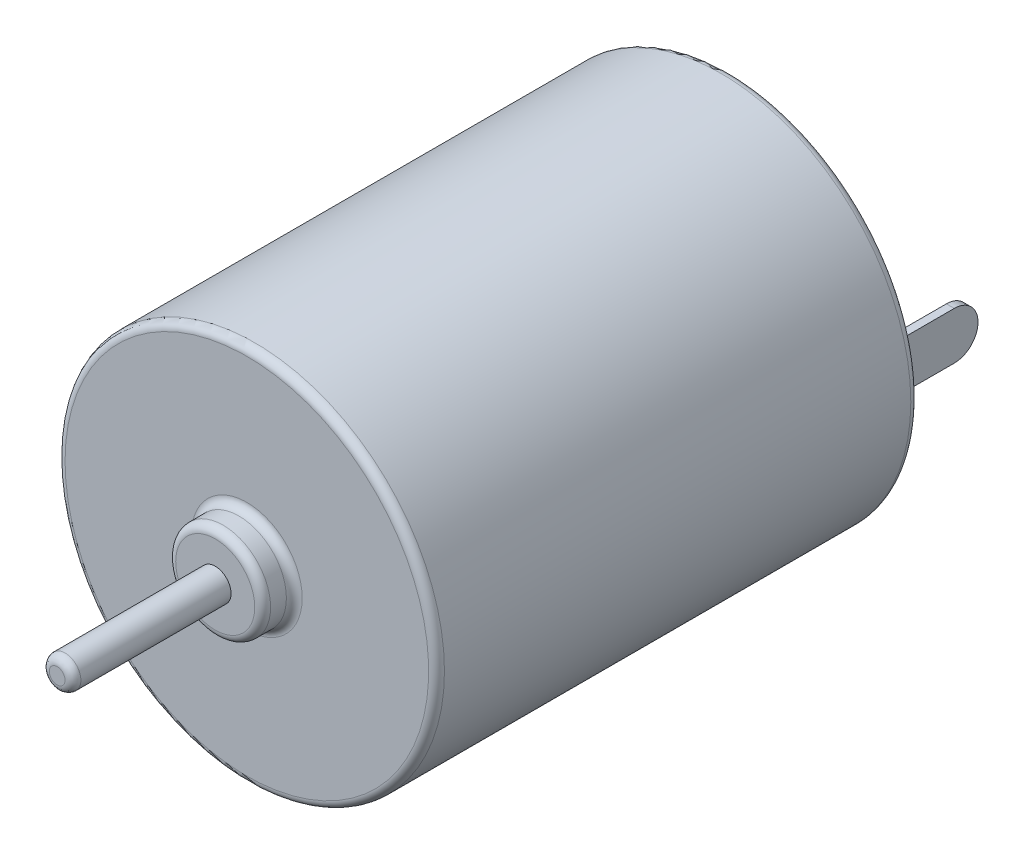
ISO-10303-21;
HEADER;
FILE_DESCRIPTION(('STEP AP214'),'2;1');
FILE_NAME('part.step','',(''),(''),'','','');
FILE_SCHEMA(('AUTOMOTIVE_DESIGN { 1 0 10303 214 1 1 1 1 }'));
ENDSEC;
DATA;
#1=APPLICATION_CONTEXT('core data for automotive mechanical design processes');
#2=APPLICATION_PROTOCOL_DEFINITION('international standard','automotive_design',2000,#1);
#3=PRODUCT_CONTEXT('',#1,'mechanical');
#4=PRODUCT('Part','Part','',(#3));
#5=PRODUCT_RELATED_PRODUCT_CATEGORY('part','',(#4));
#6=PRODUCT_DEFINITION_FORMATION('','',#4);
#7=PRODUCT_DEFINITION_CONTEXT('part definition',#1,'design');
#8=PRODUCT_DEFINITION('design','',#6,#7);
#9=PRODUCT_DEFINITION_SHAPE('','',#8);
#10=(LENGTH_UNIT() NAMED_UNIT(*) SI_UNIT(.MILLI.,.METRE.));
#11=(NAMED_UNIT(*) PLANE_ANGLE_UNIT() SI_UNIT($,.RADIAN.));
#12=(NAMED_UNIT(*) SI_UNIT($,.STERADIAN.) SOLID_ANGLE_UNIT());
#13=UNCERTAINTY_MEASURE_WITH_UNIT(LENGTH_MEASURE(1.E-05),#10,'distance_accuracy_value','');
#14=(GEOMETRIC_REPRESENTATION_CONTEXT(3) GLOBAL_UNCERTAINTY_ASSIGNED_CONTEXT((#13)) GLOBAL_UNIT_ASSIGNED_CONTEXT((#10,
#11,#12)) REPRESENTATION_CONTEXT('',''));
#15=CARTESIAN_POINT('',(0.,0.,0.));
#16=DIRECTION('',(0.,0.,1.));
#17=DIRECTION('',(1.,0.,0.));
#18=AXIS2_PLACEMENT_3D('',#15,#16,#17);
#19=CARTESIAN_POINT('',(9.75,-1.5,0.));
#20=DIRECTION('',(0.,-1.,0.));
#21=DIRECTION('',(0.,0.,-1.));
#22=AXIS2_PLACEMENT_3D('',#19,#20,#21);
#23=PLANE('',#22);
#24=DIRECTION('',(1.,0.,0.));
#25=VECTOR('',#24,1.);
#26=CARTESIAN_POINT('',(4.875,-1.5,-0.5));
#27=LINE('',#26,#25);
#28=CARTESIAN_POINT('',(9.25,-1.5,-0.5));
#29=VERTEX_POINT('',#28);
#30=CARTESIAN_POINT('',(9.75,-1.5,-0.5));
#31=VERTEX_POINT('',#30);
#32=EDGE_CURVE('E336',#29,#31,#27,.T.);
#33=ORIENTED_EDGE('',*,*,#32,.F.);
#34=DIRECTION('',(0.,0.,-1.));
#35=VECTOR('',#34,1.);
#36=CARTESIAN_POINT('',(9.25,-1.5,0.));
#37=LINE('',#36,#35);
#38=CARTESIAN_POINT('',(9.25,-1.5,-4.5));
#39=VERTEX_POINT('',#38);
#40=EDGE_CURVE('E11',#29,#39,#37,.T.);
#41=ORIENTED_EDGE('',*,*,#40,.T.);
#42=DIRECTION('',(-1.,0.,0.));
#43=VECTOR('',#42,1.);
#44=CARTESIAN_POINT('',(9.625,-1.5,-4.5));
#45=LINE('',#44,#43);
#46=CARTESIAN_POINT('',(9.75,-1.5,-4.5));
#47=VERTEX_POINT('',#46);
#48=EDGE_CURVE('E323',#47,#39,#45,.T.);
#49=ORIENTED_EDGE('',*,*,#48,.F.);
#50=DIRECTION('',(0.,0.,-1.));
#51=VECTOR('',#50,1.);
#52=CARTESIAN_POINT('',(9.75,-1.5,0.));
#53=LINE('',#52,#51);
#54=EDGE_CURVE('E237',#31,#47,#53,.T.);
#55=ORIENTED_EDGE('',*,*,#54,.F.);
#56=EDGE_LOOP('',(#33,#41,#49,#55));
#57=FACE_BOUND('',#56,.T.);
#58=ADVANCED_FACE('F16',(#57),#23,.T.);
#59=CARTESIAN_POINT('',(9.25,-1.5,0.));
#60=DIRECTION('',(-1.,0.,0.));
#61=DIRECTION('',(0.,0.,1.));
#62=AXIS2_PLACEMENT_3D('',#59,#60,#61);
#63=PLANE('',#62);
#64=DIRECTION('',(0.,-1.,0.));
#65=VECTOR('',#64,1.);
#66=CARTESIAN_POINT('',(9.25,-0.75,-0.5));
#67=LINE('',#66,#65);
#68=CARTESIAN_POINT('',(9.25,1.5,-0.5));
#69=VERTEX_POINT('',#68);
#70=EDGE_CURVE('E311',#69,#29,#67,.T.);
#71=ORIENTED_EDGE('',*,*,#70,.F.);
#72=DIRECTION('',(0.,0.,-1.));
#73=VECTOR('',#72,1.);
#74=CARTESIAN_POINT('',(9.25,1.5,0.));
#75=LINE('',#74,#73);
#76=CARTESIAN_POINT('',(9.25,1.5,-4.5));
#77=VERTEX_POINT('',#76);
#78=EDGE_CURVE('E250',#69,#77,#75,.T.);
#79=ORIENTED_EDGE('',*,*,#78,.T.);
#80=CARTESIAN_POINT('',(9.25,0.,-4.5));
#81=DIRECTION('',(1.,0.,0.));
#82=DIRECTION('',(0.,0.707106781186547,-0.707106781186548));
#83=AXIS2_PLACEMENT_3D('',#80,#81,#82);
#84=CIRCLE('',#83,1.5);
#85=EDGE_CURVE('E27',#39,#77,#84,.T.);
#86=ORIENTED_EDGE('',*,*,#85,.F.);
#87=ORIENTED_EDGE('',*,*,#40,.F.);
#88=EDGE_LOOP('',(#71,#79,#86,#87));
#89=FACE_BOUND('',#88,.T.);
#90=ADVANCED_FACE('F537',(#89),#63,.T.);
#91=CARTESIAN_POINT('',(-9.25,-1.5,0.));
#92=DIRECTION('',(0.,-1.,0.));
#93=DIRECTION('',(0.,0.,-1.));
#94=AXIS2_PLACEMENT_3D('',#91,#92,#93);
#95=PLANE('',#94);
#96=DIRECTION('',(1.,0.,0.));
#97=VECTOR('',#96,1.);
#98=CARTESIAN_POINT('',(-4.625,-1.5,-0.5));
#99=LINE('',#98,#97);
#100=CARTESIAN_POINT('',(-9.75,-1.5,-0.5));
#101=VERTEX_POINT('',#100);
#102=CARTESIAN_POINT('',(-9.25,-1.5,-0.5));
#103=VERTEX_POINT('',#102);
#104=EDGE_CURVE('E272',#101,#103,#99,.T.);
#105=ORIENTED_EDGE('',*,*,#104,.F.);
#106=DIRECTION('',(0.,0.,-1.));
#107=VECTOR('',#106,1.);
#108=CARTESIAN_POINT('',(-9.75,-1.5,0.));
#109=LINE('',#108,#107);
#110=CARTESIAN_POINT('',(-9.75,-1.5,-4.5));
#111=VERTEX_POINT('',#110);
#112=EDGE_CURVE('E362',#101,#111,#109,.T.);
#113=ORIENTED_EDGE('',*,*,#112,.T.);
#114=DIRECTION('',(-1.,0.,0.));
#115=VECTOR('',#114,1.);
#116=CARTESIAN_POINT('',(-9.375,-1.5,-4.5));
#117=LINE('',#116,#115);
#118=CARTESIAN_POINT('',(-9.25,-1.5,-4.5));
#119=VERTEX_POINT('',#118);
#120=EDGE_CURVE('E426',#119,#111,#117,.T.);
#121=ORIENTED_EDGE('',*,*,#120,.F.);
#122=DIRECTION('',(0.,0.,-1.));
#123=VECTOR('',#122,1.);
#124=CARTESIAN_POINT('',(-9.25,-1.5,0.));
#125=LINE('',#124,#123);
#126=EDGE_CURVE('E267',#103,#119,#125,.T.);
#127=ORIENTED_EDGE('',*,*,#126,.F.);
#128=EDGE_LOOP('',(#105,#113,#121,#127));
#129=FACE_BOUND('',#128,.T.);
#130=ADVANCED_FACE('F478',(#129),#95,.T.);
#131=CARTESIAN_POINT('',(9.375,0.,-4.5));
#132=DIRECTION('',(1.,0.,0.));
#133=DIRECTION('',(0.,0.707106781186547,-0.707106781186548));
#134=AXIS2_PLACEMENT_3D('',#131,#132,#133);
#135=CYLINDRICAL_SURFACE('',#134,1.5);
#136=CARTESIAN_POINT('',(9.75,0.,-4.5));
#137=DIRECTION('',(-1.,0.,0.));
#138=DIRECTION('',(0.,-0.707106781186547,-0.707106781186548));
#139=AXIS2_PLACEMENT_3D('',#136,#137,#138);
#140=CIRCLE('',#139,1.5);
#141=CARTESIAN_POINT('',(9.75,1.5,-4.5));
#142=VERTEX_POINT('',#141);
#143=EDGE_CURVE('E344',#142,#47,#140,.T.);
#144=ORIENTED_EDGE('',*,*,#143,.T.);
#145=ORIENTED_EDGE('',*,*,#48,.T.);
#146=ORIENTED_EDGE('',*,*,#85,.T.);
#147=DIRECTION('',(1.,0.,0.));
#148=VECTOR('',#147,1.);
#149=CARTESIAN_POINT('',(9.375,1.5,-4.5));
#150=LINE('',#149,#148);
#151=EDGE_CURVE('E254',#77,#142,#150,.T.);
#152=ORIENTED_EDGE('',*,*,#151,.T.);
#153=EDGE_LOOP('',(#144,#145,#146,#152));
#154=FACE_BOUND('',#153,.T.);
#155=ADVANCED_FACE('F794',(#154),#135,.T.);
#156=CARTESIAN_POINT('',(-9.625,0.,-4.5));
#157=DIRECTION('',(1.,0.,0.));
#158=DIRECTION('',(0.,0.707106781186547,-0.707106781186548));
#159=AXIS2_PLACEMENT_3D('',#156,#157,#158);
#160=CYLINDRICAL_SURFACE('',#159,1.5);
#161=CARTESIAN_POINT('',(-9.25,0.,-4.5));
#162=DIRECTION('',(-1.,0.,0.));
#163=DIRECTION('',(0.,-0.707106781186547,-0.707106781186548));
#164=AXIS2_PLACEMENT_3D('',#161,#162,#163);
#165=CIRCLE('',#164,1.5);
#166=CARTESIAN_POINT('',(-9.25,1.5,-4.5));
#167=VERTEX_POINT('',#166);
#168=EDGE_CURVE('E384',#167,#119,#165,.T.);
#169=ORIENTED_EDGE('',*,*,#168,.T.);
#170=ORIENTED_EDGE('',*,*,#120,.T.);
#171=CARTESIAN_POINT('',(-9.75,0.,-4.5));
#172=DIRECTION('',(1.,0.,0.));
#173=DIRECTION('',(0.,0.707106781186547,-0.707106781186548));
#174=AXIS2_PLACEMENT_3D('',#171,#172,#173);
#175=CIRCLE('',#174,1.5);
#176=CARTESIAN_POINT('',(-9.75,1.5,-4.5));
#177=VERTEX_POINT('',#176);
#178=EDGE_CURVE('E261',#111,#177,#175,.T.);
#179=ORIENTED_EDGE('',*,*,#178,.T.);
#180=DIRECTION('',(1.,0.,0.));
#181=VECTOR('',#180,1.);
#182=CARTESIAN_POINT('',(-9.625,1.5,-4.5));
#183=LINE('',#182,#181);
#184=EDGE_CURVE('E368',#177,#167,#183,.T.);
#185=ORIENTED_EDGE('',*,*,#184,.T.);
#186=EDGE_LOOP('',(#169,#170,#179,#185));
#187=FACE_BOUND('',#186,.T.);
#188=ADVANCED_FACE('F452',(#187),#160,.T.);
#189=CARTESIAN_POINT('',(-9.25,1.5,0.));
#190=DIRECTION('',(1.,0.,0.));
#191=DIRECTION('',(0.,1.,0.));
#192=AXIS2_PLACEMENT_3D('',#189,#190,#191);
#193=PLANE('',#192);
#194=DIRECTION('',(0.,1.,0.));
#195=VECTOR('',#194,1.);
#196=CARTESIAN_POINT('',(-9.25,0.75,-0.5));
#197=LINE('',#196,#195);
#198=CARTESIAN_POINT('',(-9.25,1.5,-0.5));
#199=VERTEX_POINT('',#198);
#200=EDGE_CURVE('E262',#103,#199,#197,.T.);
#201=ORIENTED_EDGE('',*,*,#200,.F.);
#202=ORIENTED_EDGE('',*,*,#126,.T.);
#203=ORIENTED_EDGE('',*,*,#168,.F.);
#204=DIRECTION('',(0.,0.,-1.));
#205=VECTOR('',#204,1.);
#206=CARTESIAN_POINT('',(-9.25,1.5,0.));
#207=LINE('',#206,#205);
#208=EDGE_CURVE('E381',#199,#167,#207,.T.);
#209=ORIENTED_EDGE('',*,*,#208,.F.);
#210=EDGE_LOOP('',(#201,#202,#203,#209));
#211=FACE_BOUND('',#210,.T.);
#212=ADVANCED_FACE('F459',(#211),#193,.T.);
#213=CARTESIAN_POINT('',(0.,0.,-2.5));
#214=DIRECTION('',(0.,0.,-1.));
#215=DIRECTION('',(0.,-1.,0.));
#216=AXIS2_PLACEMENT_3D('',#213,#214,#215);
#217=PLANE('',#216);
#218=CARTESIAN_POINT('',(0.,0.,-2.5));
#219=DIRECTION('',(0.,0.,1.));
#220=DIRECTION('',(1.,0.,0.));
#221=AXIS2_PLACEMENT_3D('',#218,#219,#220);
#222=CIRCLE('',#221,3.5);
#223=CARTESIAN_POINT('',(3.5,0.,-2.5));
#224=VERTEX_POINT('',#223);
#225=EDGE_CURVE('E248',#224,#224,#222,.T.);
#226=ORIENTED_EDGE('',*,*,#225,.F.);
#227=EDGE_LOOP('',(#226));
#228=FACE_BOUND('',#227,.T.);
#229=ADVANCED_FACE('F691',(#228),#217,.T.);
#230=CARTESIAN_POINT('',(0.,0.,-2.));
#231=DIRECTION('',(0.,0.,-1.));
#232=DIRECTION('',(-1.,0.,0.));
#233=AXIS2_PLACEMENT_3D('',#230,#231,#232);
#234=TOROIDAL_SURFACE('',#233,3.5,0.5);
#235=ORIENTED_EDGE('',*,*,#225,.T.);
#236=CARTESIAN_POINT('',(3.5,0.,-2.));
#237=DIRECTION('',(0.,-1.,0.));
#238=DIRECTION('',(1.,0.,0.));
#239=AXIS2_PLACEMENT_3D('',#236,#237,#238);
#240=CIRCLE('',#239,0.5);
#241=CARTESIAN_POINT('',(4.,0.,-2.));
#242=VERTEX_POINT('',#241);
#243=EDGE_CURVE('E264',#224,#242,#240,.T.);
#244=ORIENTED_EDGE('',*,*,#243,.T.);
#245=CARTESIAN_POINT('',(0.,0.,-2.));
#246=DIRECTION('',(0.,0.,-1.));
#247=DIRECTION('',(1.,0.,0.));
#248=AXIS2_PLACEMENT_3D('',#245,#246,#247);
#249=CIRCLE('',#248,4.);
#250=CARTESIAN_POINT('',(-4.,0.,-2.));
#251=VERTEX_POINT('',#250);
#252=EDGE_CURVE('E245',#242,#251,#249,.T.);
#253=ORIENTED_EDGE('',*,*,#252,.T.);
#254=CARTESIAN_POINT('',(0.,0.,-2.));
#255=DIRECTION('',(0.,0.,-1.));
#256=DIRECTION('',(1.,0.,0.));
#257=AXIS2_PLACEMENT_3D('',#254,#255,#256);
#258=CIRCLE('',#257,4.);
#259=EDGE_CURVE('E422',#251,#242,#258,.T.);
#260=ORIENTED_EDGE('',*,*,#259,.T.);
#261=ORIENTED_EDGE('',*,*,#243,.F.);
#262=EDGE_LOOP('',(#235,#244,#253,#260,#261));
#263=FACE_BOUND('',#262,.T.);
#264=ADVANCED_FACE('F697',(#263),#234,.T.);
#265=CARTESIAN_POINT('',(0.,0.,0.));
#266=DIRECTION('',(0.,0.,-1.));
#267=DIRECTION('',(1.,0.,0.));
#268=AXIS2_PLACEMENT_3D('',#265,#266,#267);
#269=CYLINDRICAL_SURFACE('',#268,4.);
#270=ORIENTED_EDGE('',*,*,#259,.F.);
#271=DIRECTION('',(0.,0.,1.));
#272=VECTOR('',#271,1.);
#273=CARTESIAN_POINT('',(-4.,0.,0.));
#274=LINE('',#273,#272);
#275=CARTESIAN_POINT('',(-4.,0.,-0.5));
#276=VERTEX_POINT('',#275);
#277=EDGE_CURVE('E249',#251,#276,#274,.T.);
#278=ORIENTED_EDGE('',*,*,#277,.T.);
#279=CARTESIAN_POINT('',(0.,0.,-0.5));
#280=DIRECTION('',(0.,0.,1.));
#281=DIRECTION('',(1.,0.,0.));
#282=AXIS2_PLACEMENT_3D('',#279,#280,#281);
#283=CIRCLE('',#282,4.);
#284=EDGE_CURVE('E239',#276,#276,#283,.T.);
#285=ORIENTED_EDGE('',*,*,#284,.F.);
#286=ORIENTED_EDGE('',*,*,#277,.F.);
#287=ORIENTED_EDGE('',*,*,#252,.F.);
#288=EDGE_LOOP('',(#270,#278,#285,#286,#287));
#289=FACE_BOUND('',#288,.T.);
#290=ADVANCED_FACE('F565',(#289),#269,.T.);
#291=CARTESIAN_POINT('',(0.,0.,-0.5));
#292=DIRECTION('',(0.,0.,1.));
#293=DIRECTION('',(1.,0.,0.));
#294=AXIS2_PLACEMENT_3D('',#291,#292,#293);
#295=TOROIDAL_SURFACE('',#294,4.5,0.5);
#296=ORIENTED_EDGE('',*,*,#284,.T.);
#297=CARTESIAN_POINT('',(-4.5,0.,-0.5));
#298=DIRECTION('',(0.,-1.,0.));
#299=DIRECTION('',(-1.,0.,0.));
#300=AXIS2_PLACEMENT_3D('',#297,#298,#299);
#301=CIRCLE('',#300,0.5);
#302=CARTESIAN_POINT('',(-4.5,0.,0.));
#303=VERTEX_POINT('',#302);
#304=EDGE_CURVE('E243',#276,#303,#301,.T.);
#305=ORIENTED_EDGE('',*,*,#304,.T.);
#306=CARTESIAN_POINT('',(0.,0.,0.));
#307=DIRECTION('',(0.,0.,-1.));
#308=DIRECTION('',(1.,0.,0.));
#309=AXIS2_PLACEMENT_3D('',#306,#307,#308);
#310=CIRCLE('',#309,4.5);
#311=EDGE_CURVE('E273',#303,#303,#310,.T.);
#312=ORIENTED_EDGE('',*,*,#311,.T.);
#313=ORIENTED_EDGE('',*,*,#304,.F.);
#314=EDGE_LOOP('',(#296,#305,#312,#313));
#315=FACE_BOUND('',#314,.T.);
#316=ADVANCED_FACE('F556',(#315),#295,.F.);
#317=CARTESIAN_POINT('',(0.,0.,0.5));
#318=DIRECTION('',(0.,0.,1.));
#319=DIRECTION('',(1.,0.,0.));
#320=AXIS2_PLACEMENT_3D('',#317,#318,#319);
#321=TOROIDAL_SURFACE('',#320,11.5,0.5);
#322=CARTESIAN_POINT('',(0.,0.,0.5));
#323=DIRECTION('',(0.,0.,-1.));
#324=DIRECTION('',(1.,0.,0.));
#325=AXIS2_PLACEMENT_3D('',#322,#323,#324);
#326=CIRCLE('',#325,12.);
#327=CARTESIAN_POINT('',(-12.,0.,0.5));
#328=VERTEX_POINT('',#327);
#329=EDGE_CURVE('E293',#328,#328,#326,.T.);
#330=ORIENTED_EDGE('',*,*,#329,.T.);
#331=CARTESIAN_POINT('',(-11.5,0.,0.5));
#332=DIRECTION('',(0.,-1.,0.));
#333=DIRECTION('',(-1.,0.,0.));
#334=AXIS2_PLACEMENT_3D('',#331,#332,#333);
#335=CIRCLE('',#334,0.5);
#336=CARTESIAN_POINT('',(-11.5,0.,0.));
#337=VERTEX_POINT('',#336);
#338=EDGE_CURVE('E244',#328,#337,#335,.T.);
#339=ORIENTED_EDGE('',*,*,#338,.T.);
#340=CARTESIAN_POINT('',(0.,0.,0.));
#341=DIRECTION('',(0.,0.,1.));
#342=DIRECTION('',(1.,0.,0.));
#343=AXIS2_PLACEMENT_3D('',#340,#341,#342);
#344=CIRCLE('',#343,11.5);
#345=EDGE_CURVE('E348',#337,#337,#344,.T.);
#346=ORIENTED_EDGE('',*,*,#345,.T.);
#347=ORIENTED_EDGE('',*,*,#338,.F.);
#348=EDGE_LOOP('',(#330,#339,#346,#347));
#349=FACE_BOUND('',#348,.T.);
#350=ADVANCED_FACE('F548',(#349),#321,.T.);
#351=CARTESIAN_POINT('',(0.,0.,32.5));
#352=DIRECTION('',(0.,0.,1.));
#353=DIRECTION('',(1.,0.,0.));
#354=AXIS2_PLACEMENT_3D('',#351,#352,#353);
#355=PLANE('',#354);
#356=CARTESIAN_POINT('',(0.,0.,32.5));
#357=DIRECTION('',(0.,0.,-1.));
#358=DIRECTION('',(-1.,0.,0.));
#359=AXIS2_PLACEMENT_3D('',#356,#357,#358);
#360=CIRCLE('',#359,1.);
#361=CARTESIAN_POINT('',(1.,0.,32.5));
#362=VERTEX_POINT('',#361);
#363=EDGE_CURVE('E257',#362,#362,#360,.T.);
#364=ORIENTED_EDGE('',*,*,#363,.T.);
#365=EDGE_LOOP('',(#364));
#366=FACE_BOUND('',#365,.T.);
#367=CARTESIAN_POINT('',(0.,0.,32.5));
#368=DIRECTION('',(0.,0.,-1.));
#369=DIRECTION('',(-1.,0.,0.));
#370=AXIS2_PLACEMENT_3D('',#367,#368,#369);
#371=CIRCLE('',#370,2.5);
#372=CARTESIAN_POINT('',(-2.5,0.,32.5));
#373=VERTEX_POINT('',#372);
#374=EDGE_CURVE('E282',#373,#373,#371,.T.);
#375=ORIENTED_EDGE('',*,*,#374,.F.);
#376=EDGE_LOOP('',(#375));
#377=FACE_BOUND('',#376,.T.);
#378=ADVANCED_FACE('F555',(#366,#377),#355,.T.);
#379=CARTESIAN_POINT('',(0.,0.,32.));
#380=DIRECTION('',(0.,0.,1.));
#381=DIRECTION('',(1.,0.,0.));
#382=AXIS2_PLACEMENT_3D('',#379,#380,#381);
#383=TOROIDAL_SURFACE('',#382,2.5,0.5);
#384=ORIENTED_EDGE('',*,*,#374,.T.);
#385=CARTESIAN_POINT('',(-2.5,0.,32.));
#386=DIRECTION('',(0.,-1.,0.));
#387=DIRECTION('',(-1.,0.,0.));
#388=AXIS2_PLACEMENT_3D('',#385,#386,#387);
#389=CIRCLE('',#388,0.5);
#390=CARTESIAN_POINT('',(-3.,0.,32.));
#391=VERTEX_POINT('',#390);
#392=EDGE_CURVE('E279',#373,#391,#389,.T.);
#393=ORIENTED_EDGE('',*,*,#392,.T.);
#394=CARTESIAN_POINT('',(0.,0.,32.));
#395=DIRECTION('',(0.,0.,1.));
#396=DIRECTION('',(-1.,0.,0.));
#397=AXIS2_PLACEMENT_3D('',#394,#395,#396);
#398=CIRCLE('',#397,3.);
#399=CARTESIAN_POINT('',(3.,0.,32.));
#400=VERTEX_POINT('',#399);
#401=EDGE_CURVE('E20',#391,#400,#398,.T.);
#402=ORIENTED_EDGE('',*,*,#401,.T.);
#403=CARTESIAN_POINT('',(0.,0.,32.));
#404=DIRECTION('',(0.,0.,1.));
#405=DIRECTION('',(-1.,0.,0.));
#406=AXIS2_PLACEMENT_3D('',#403,#404,#405);
#407=CIRCLE('',#406,3.);
#408=EDGE_CURVE('E396',#400,#391,#407,.T.);
#409=ORIENTED_EDGE('',*,*,#408,.T.);
#410=ORIENTED_EDGE('',*,*,#392,.F.);
#411=EDGE_LOOP('',(#384,#393,#402,#409,#410));
#412=FACE_BOUND('',#411,.T.);
#413=ADVANCED_FACE('F562',(#412),#383,.T.);
#414=CARTESIAN_POINT('',(0.,0.,30.5));
#415=DIRECTION('',(0.,0.,1.));
#416=DIRECTION('',(-1.,0.,0.));
#417=AXIS2_PLACEMENT_3D('',#414,#415,#416);
#418=CYLINDRICAL_SURFACE('',#417,3.);
#419=ORIENTED_EDGE('',*,*,#408,.F.);
#420=DIRECTION('',(0.,0.,-1.));
#421=VECTOR('',#420,1.);
#422=CARTESIAN_POINT('',(3.,0.,30.5));
#423=LINE('',#422,#421);
#424=CARTESIAN_POINT('',(3.,0.,31.));
#425=VERTEX_POINT('',#424);
#426=EDGE_CURVE('E400',#400,#425,#423,.T.);
#427=ORIENTED_EDGE('',*,*,#426,.T.);
#428=CARTESIAN_POINT('',(0.,0.,31.));
#429=DIRECTION('',(0.,0.,-1.));
#430=DIRECTION('',(-1.,0.,0.));
#431=AXIS2_PLACEMENT_3D('',#428,#429,#430);
#432=CIRCLE('',#431,3.);
#433=EDGE_CURVE('E288',#425,#425,#432,.T.);
#434=ORIENTED_EDGE('',*,*,#433,.F.);
#435=ORIENTED_EDGE('',*,*,#426,.F.);
#436=ORIENTED_EDGE('',*,*,#401,.F.);
#437=EDGE_LOOP('',(#419,#427,#434,#435,#436));
#438=FACE_BOUND('',#437,.T.);
#439=ADVANCED_FACE('F722',(#438),#418,.T.);
#440=CARTESIAN_POINT('',(0.,0.,31.));
#441=DIRECTION('',(0.,0.,-1.));
#442=DIRECTION('',(-1.,0.,0.));
#443=AXIS2_PLACEMENT_3D('',#440,#441,#442);
#444=TOROIDAL_SURFACE('',#443,3.5,0.5);
#445=ORIENTED_EDGE('',*,*,#433,.T.);
#446=CARTESIAN_POINT('',(3.5,0.,31.));
#447=DIRECTION('',(0.,-1.,0.));
#448=DIRECTION('',(1.,0.,0.));
#449=AXIS2_PLACEMENT_3D('',#446,#447,#448);
#450=CIRCLE('',#449,0.5);
#451=CARTESIAN_POINT('',(3.5,0.,30.5));
#452=VERTEX_POINT('',#451);
#453=EDGE_CURVE('E292',#425,#452,#450,.T.);
#454=ORIENTED_EDGE('',*,*,#453,.T.);
#455=CARTESIAN_POINT('',(0.,0.,30.5));
#456=DIRECTION('',(0.,0.,1.));
#457=DIRECTION('',(-1.,0.,0.));
#458=AXIS2_PLACEMENT_3D('',#455,#456,#457);
#459=CIRCLE('',#458,3.5);
#460=EDGE_CURVE('E297',#452,#452,#459,.T.);
#461=ORIENTED_EDGE('',*,*,#460,.T.);
#462=ORIENTED_EDGE('',*,*,#453,.F.);
#463=EDGE_LOOP('',(#445,#454,#461,#462));
#464=FACE_BOUND('',#463,.T.);
#465=ADVANCED_FACE('F530',(#464),#444,.F.);
#466=CARTESIAN_POINT('',(0.,0.,0.));
#467=DIRECTION('',(0.,0.,1.));
#468=DIRECTION('',(1.,0.,0.));
#469=AXIS2_PLACEMENT_3D('',#466,#467,#468);
#470=CYLINDRICAL_SURFACE('',#469,12.);
#471=CARTESIAN_POINT('',(0.,0.,30.));
#472=DIRECTION('',(0.,0.,1.));
#473=DIRECTION('',(1.,0.,0.));
#474=AXIS2_PLACEMENT_3D('',#471,#472,#473);
#475=CIRCLE('',#474,12.);
#476=CARTESIAN_POINT('',(-12.,0.,30.));
#477=VERTEX_POINT('',#476);
#478=EDGE_CURVE('E411',#477,#477,#475,.T.);
#479=ORIENTED_EDGE('',*,*,#478,.F.);
#480=DIRECTION('',(0.,0.,-1.));
#481=VECTOR('',#480,1.);
#482=CARTESIAN_POINT('',(-12.,0.,0.));
#483=LINE('',#482,#481);
#484=EDGE_CURVE('E294',#477,#328,#483,.T.);
#485=ORIENTED_EDGE('',*,*,#484,.T.);
#486=ORIENTED_EDGE('',*,*,#329,.F.);
#487=ORIENTED_EDGE('',*,*,#484,.F.);
#488=EDGE_LOOP('',(#479,#485,#486,#487));
#489=FACE_BOUND('',#488,.T.);
#490=ADVANCED_FACE('F521',(#489),#470,.T.);
#491=CARTESIAN_POINT('',(0.,0.,30.5));
#492=DIRECTION('',(0.,0.,1.));
#493=DIRECTION('',(1.,0.,0.));
#494=AXIS2_PLACEMENT_3D('',#491,#492,#493);
#495=PLANE('',#494);
#496=ORIENTED_EDGE('',*,*,#460,.F.);
#497=EDGE_LOOP('',(#496));
#498=FACE_BOUND('',#497,.T.);
#499=CARTESIAN_POINT('',(0.,0.,30.5));
#500=DIRECTION('',(0.,0.,-1.));
#501=DIRECTION('',(1.,0.,0.));
#502=AXIS2_PLACEMENT_3D('',#499,#500,#501);
#503=CIRCLE('',#502,11.5);
#504=CARTESIAN_POINT('',(-11.5,0.,30.5));
#505=VERTEX_POINT('',#504);
#506=EDGE_CURVE('E363',#505,#505,#503,.T.);
#507=ORIENTED_EDGE('',*,*,#506,.F.);
#508=EDGE_LOOP('',(#507));
#509=FACE_BOUND('',#508,.T.);
#510=ADVANCED_FACE('F519',(#498,#509),#495,.T.);
#511=CARTESIAN_POINT('',(0.,0.,30.));
#512=DIRECTION('',(0.,0.,1.));
#513=DIRECTION('',(1.,0.,0.));
#514=AXIS2_PLACEMENT_3D('',#511,#512,#513);
#515=TOROIDAL_SURFACE('',#514,11.5,0.5);
#516=ORIENTED_EDGE('',*,*,#506,.T.);
#517=CARTESIAN_POINT('',(-11.5,0.,30.));
#518=DIRECTION('',(0.,-1.,0.));
#519=DIRECTION('',(-1.,0.,0.));
#520=AXIS2_PLACEMENT_3D('',#517,#518,#519);
#521=CIRCLE('',#520,0.5);
#522=EDGE_CURVE('E367',#505,#477,#521,.T.);
#523=ORIENTED_EDGE('',*,*,#522,.T.);
#524=ORIENTED_EDGE('',*,*,#478,.T.);
#525=ORIENTED_EDGE('',*,*,#522,.F.);
#526=EDGE_LOOP('',(#516,#523,#524,#525));
#527=FACE_BOUND('',#526,.T.);
#528=ADVANCED_FACE('F515',(#527),#515,.T.);
#529=CARTESIAN_POINT('',(-9.75,1.5,0.));
#530=DIRECTION('',(0.,1.,0.));
#531=DIRECTION('',(1.,0.,0.));
#532=AXIS2_PLACEMENT_3D('',#529,#530,#531);
#533=PLANE('',#532);
#534=DIRECTION('',(-1.,0.,0.));
#535=VECTOR('',#534,1.);
#536=CARTESIAN_POINT('',(-4.875,1.5,-0.5));
#537=LINE('',#536,#535);
#538=CARTESIAN_POINT('',(-9.75,1.5,-0.5));
#539=VERTEX_POINT('',#538);
#540=EDGE_CURVE('E271',#199,#539,#537,.T.);
#541=ORIENTED_EDGE('',*,*,#540,.F.);
#542=ORIENTED_EDGE('',*,*,#208,.T.);
#543=ORIENTED_EDGE('',*,*,#184,.F.);
#544=DIRECTION('',(0.,0.,-1.));
#545=VECTOR('',#544,1.);
#546=CARTESIAN_POINT('',(-9.75,1.5,0.));
#547=LINE('',#546,#545);
#548=EDGE_CURVE('E258',#539,#177,#547,.T.);
#549=ORIENTED_EDGE('',*,*,#548,.F.);
#550=EDGE_LOOP('',(#541,#542,#543,#549));
#551=FACE_BOUND('',#550,.T.);
#552=ADVANCED_FACE('F456',(#551),#533,.T.);
#553=CARTESIAN_POINT('',(-9.75,-1.5,0.));
#554=DIRECTION('',(-1.,0.,0.));
#555=DIRECTION('',(0.,0.,1.));
#556=AXIS2_PLACEMENT_3D('',#553,#554,#555);
#557=PLANE('',#556);
#558=DIRECTION('',(0.,-1.,0.));
#559=VECTOR('',#558,1.);
#560=CARTESIAN_POINT('',(-9.75,-0.75,-0.5));
#561=LINE('',#560,#559);
#562=EDGE_CURVE('E369',#539,#101,#561,.T.);
#563=ORIENTED_EDGE('',*,*,#562,.F.);
#564=ORIENTED_EDGE('',*,*,#548,.T.);
#565=ORIENTED_EDGE('',*,*,#178,.F.);
#566=ORIENTED_EDGE('',*,*,#112,.F.);
#567=EDGE_LOOP('',(#563,#564,#565,#566));
#568=FACE_BOUND('',#567,.T.);
#569=ADVANCED_FACE('F481',(#568),#557,.T.);
#570=CARTESIAN_POINT('',(-8.75,0.75,-0.5));
#571=DIRECTION('',(0.,1.,0.));
#572=DIRECTION('',(-0.707106781186548,0.,0.707106781186547));
#573=AXIS2_PLACEMENT_3D('',#570,#571,#572);
#574=CYLINDRICAL_SURFACE('',#573,0.5);
#575=DIRECTION('',(0.,-1.,0.));
#576=VECTOR('',#575,1.);
#577=CARTESIAN_POINT('',(-8.75,0.75,0.));
#578=LINE('',#577,#576);
#579=CARTESIAN_POINT('',(-8.75,2.,0.));
#580=VERTEX_POINT('',#579);
#581=CARTESIAN_POINT('',(-8.75,-2.,0.));
#582=VERTEX_POINT('',#581);
#583=EDGE_CURVE('E278',#580,#582,#578,.T.);
#584=ORIENTED_EDGE('',*,*,#583,.T.);
#585=CARTESIAN_POINT('',(-8.75,-2.,-0.5));
#586=DIRECTION('',(0.707106781186547,0.707106781186548,0.));
#587=DIRECTION('',(-0.707106781186548,0.707106781186547,0.));
#588=AXIS2_PLACEMENT_3D('',#585,#586,#587);
#589=ELLIPSE('',#588,0.707106781186548,0.5);
#590=EDGE_CURVE('E268',#103,#582,#589,.T.);
#591=ORIENTED_EDGE('',*,*,#590,.F.);
#592=ORIENTED_EDGE('',*,*,#200,.T.);
#593=CARTESIAN_POINT('',(-8.75,2.,-0.5));
#594=DIRECTION('',(-0.707106781186547,0.707106781186548,0.));
#595=DIRECTION('',(-0.707106781186548,-0.707106781186547,0.));
#596=AXIS2_PLACEMENT_3D('',#593,#594,#595);
#597=ELLIPSE('',#596,0.707106781186547,0.5);
#598=EDGE_CURVE('E373',#199,#580,#597,.T.);
#599=ORIENTED_EDGE('',*,*,#598,.T.);
#600=EDGE_LOOP('',(#584,#591,#592,#599));
#601=FACE_BOUND('',#600,.T.);
#602=ADVANCED_FACE('F463',(#601),#574,.F.);
#603=CARTESIAN_POINT('',(-10.25,-0.75,-0.5));
#604=DIRECTION('',(0.,-1.,0.));
#605=DIRECTION('',(0.707106781186549,0.,0.707106781186546));
#606=AXIS2_PLACEMENT_3D('',#603,#604,#605);
#607=CYLINDRICAL_SURFACE('',#606,0.5);
#608=DIRECTION('',(0.,1.,0.));
#609=VECTOR('',#608,1.);
#610=CARTESIAN_POINT('',(-10.25,-0.75,0.));
#611=LINE('',#610,#609);
#612=CARTESIAN_POINT('',(-10.25,-2.,0.));
#613=VERTEX_POINT('',#612);
#614=CARTESIAN_POINT('',(-10.25,2.,0.));
#615=VERTEX_POINT('',#614);
#616=EDGE_CURVE('E358',#613,#615,#611,.T.);
#617=ORIENTED_EDGE('',*,*,#616,.T.);
#618=CARTESIAN_POINT('',(-10.25,2.,-0.5));
#619=DIRECTION('',(-0.707106781186547,-0.707106781186548,0.));
#620=DIRECTION('',(0.707106781186548,-0.707106781186547,0.));
#621=AXIS2_PLACEMENT_3D('',#618,#619,#620);
#622=ELLIPSE('',#621,0.707106781186548,0.5);
#623=EDGE_CURVE('E340',#539,#615,#622,.T.);
#624=ORIENTED_EDGE('',*,*,#623,.F.);
#625=ORIENTED_EDGE('',*,*,#562,.T.);
#626=CARTESIAN_POINT('',(-10.25,-2.,-0.5));
#627=DIRECTION('',(-0.707106781186547,0.707106781186548,0.));
#628=DIRECTION('',(-0.707106781186548,-0.707106781186547,0.));
#629=AXIS2_PLACEMENT_3D('',#626,#627,#628);
#630=ELLIPSE('',#629,0.707106781186548,0.5);
#631=EDGE_CURVE('E277',#613,#101,#630,.T.);
#632=ORIENTED_EDGE('',*,*,#631,.F.);
#633=EDGE_LOOP('',(#617,#624,#625,#632));
#634=FACE_BOUND('',#633,.T.);
#635=ADVANCED_FACE('F483',(#634),#607,.F.);
#636=CARTESIAN_POINT('',(-4.875,2.,-0.5));
#637=DIRECTION('',(-1.,0.,0.));
#638=DIRECTION('',(0.,-0.707106781186548,0.707106781186547));
#639=AXIS2_PLACEMENT_3D('',#636,#637,#638);
#640=CYLINDRICAL_SURFACE('',#639,0.5);
#641=ORIENTED_EDGE('',*,*,#540,.T.);
#642=ORIENTED_EDGE('',*,*,#623,.T.);
#643=DIRECTION('',(1.,0.,0.));
#644=VECTOR('',#643,1.);
#645=CARTESIAN_POINT('',(-4.875,2.,0.));
#646=LINE('',#645,#644);
#647=EDGE_CURVE('E354',#615,#580,#646,.T.);
#648=ORIENTED_EDGE('',*,*,#647,.T.);
#649=ORIENTED_EDGE('',*,*,#598,.F.);
#650=EDGE_LOOP('',(#641,#642,#648,#649));
#651=FACE_BOUND('',#650,.T.);
#652=ADVANCED_FACE('F466',(#651),#640,.F.);
#653=CARTESIAN_POINT('',(-4.625,-2.,-0.5));
#654=DIRECTION('',(1.,0.,0.));
#655=DIRECTION('',(0.,0.707106781186548,0.707106781186547));
#656=AXIS2_PLACEMENT_3D('',#653,#654,#655);
#657=CYLINDRICAL_SURFACE('',#656,0.5);
#658=DIRECTION('',(-1.,0.,0.));
#659=VECTOR('',#658,1.);
#660=CARTESIAN_POINT('',(-4.625,-2.,0.));
#661=LINE('',#660,#659);
#662=EDGE_CURVE('E328',#582,#613,#661,.T.);
#663=ORIENTED_EDGE('',*,*,#662,.T.);
#664=ORIENTED_EDGE('',*,*,#631,.T.);
#665=ORIENTED_EDGE('',*,*,#104,.T.);
#666=ORIENTED_EDGE('',*,*,#590,.T.);
#667=EDGE_LOOP('',(#663,#664,#665,#666));
#668=FACE_BOUND('',#667,.T.);
#669=ADVANCED_FACE('F18',(#668),#657,.F.);
#670=CARTESIAN_POINT('',(0.,0.,0.));
#671=DIRECTION('',(0.,0.,1.));
#672=DIRECTION('',(1.,0.,0.));
#673=AXIS2_PLACEMENT_3D('',#670,#671,#672);
#674=PLANE('',#673);
#675=DIRECTION('',(0.,-1.,0.));
#676=VECTOR('',#675,1.);
#677=CARTESIAN_POINT('',(10.25,0.75,0.));
#678=LINE('',#677,#676);
#679=CARTESIAN_POINT('',(10.25,2.,0.));
#680=VERTEX_POINT('',#679);
#681=CARTESIAN_POINT('',(10.25,-2.,0.));
#682=VERTEX_POINT('',#681);
#683=EDGE_CURVE('E283',#680,#682,#678,.T.);
#684=ORIENTED_EDGE('',*,*,#683,.F.);
#685=DIRECTION('',(1.,0.,0.));
#686=VECTOR('',#685,1.);
#687=CARTESIAN_POINT('',(4.625,2.,0.));
#688=LINE('',#687,#686);
#689=CARTESIAN_POINT('',(8.75,2.,0.));
#690=VERTEX_POINT('',#689);
#691=EDGE_CURVE('E313',#690,#680,#688,.T.);
#692=ORIENTED_EDGE('',*,*,#691,.F.);
#693=DIRECTION('',(0.,1.,0.));
#694=VECTOR('',#693,1.);
#695=CARTESIAN_POINT('',(8.75,-0.75,0.));
#696=LINE('',#695,#694);
#697=CARTESIAN_POINT('',(8.75,-2.,0.));
#698=VERTEX_POINT('',#697);
#699=EDGE_CURVE('E301',#698,#690,#696,.T.);
#700=ORIENTED_EDGE('',*,*,#699,.F.);
#701=DIRECTION('',(-1.,0.,0.));
#702=VECTOR('',#701,1.);
#703=CARTESIAN_POINT('',(4.875,-2.,0.));
#704=LINE('',#703,#702);
#705=EDGE_CURVE('E332',#682,#698,#704,.T.);
#706=ORIENTED_EDGE('',*,*,#705,.F.);
#707=EDGE_LOOP('',(#684,#692,#700,#706));
#708=FACE_BOUND('',#707,.T.);
#709=ORIENTED_EDGE('',*,*,#311,.F.);
#710=EDGE_LOOP('',(#709));
#711=FACE_BOUND('',#710,.T.);
#712=ORIENTED_EDGE('',*,*,#647,.F.);
#713=ORIENTED_EDGE('',*,*,#616,.F.);
#714=ORIENTED_EDGE('',*,*,#662,.F.);
#715=ORIENTED_EDGE('',*,*,#583,.F.);
#716=EDGE_LOOP('',(#712,#713,#714,#715));
#717=FACE_BOUND('',#716,.T.);
#718=ORIENTED_EDGE('',*,*,#345,.F.);
#719=EDGE_LOOP('',(#718));
#720=FACE_BOUND('',#719,.T.);
#721=ADVANCED_FACE('F471',(#708,#711,#717,#720),#674,.F.);
#722=CARTESIAN_POINT('',(9.75,1.5,0.));
#723=DIRECTION('',(1.,0.,0.));
#724=DIRECTION('',(0.,1.,0.));
#725=AXIS2_PLACEMENT_3D('',#722,#723,#724);
#726=PLANE('',#725);
#727=DIRECTION('',(0.,1.,0.));
#728=VECTOR('',#727,1.);
#729=CARTESIAN_POINT('',(9.75,0.75,-0.5));
#730=LINE('',#729,#728);
#731=CARTESIAN_POINT('',(9.75,1.5,-0.5));
#732=VERTEX_POINT('',#731);
#733=EDGE_CURVE('E391',#31,#732,#730,.T.);
#734=ORIENTED_EDGE('',*,*,#733,.F.);
#735=ORIENTED_EDGE('',*,*,#54,.T.);
#736=ORIENTED_EDGE('',*,*,#143,.F.);
#737=DIRECTION('',(0.,0.,-1.));
#738=VECTOR('',#737,1.);
#739=CARTESIAN_POINT('',(9.75,1.5,0.));
#740=LINE('',#739,#738);
#741=EDGE_CURVE('E169',#732,#142,#740,.T.);
#742=ORIENTED_EDGE('',*,*,#741,.F.);
#743=EDGE_LOOP('',(#734,#735,#736,#742));
#744=FACE_BOUND('',#743,.T.);
#745=ADVANCED_FACE('F743',(#744),#726,.T.);
#746=CARTESIAN_POINT('',(9.25,1.5,0.));
#747=DIRECTION('',(0.,1.,0.));
#748=DIRECTION('',(1.,0.,0.));
#749=AXIS2_PLACEMENT_3D('',#746,#747,#748);
#750=PLANE('',#749);
#751=DIRECTION('',(-1.,0.,0.));
#752=VECTOR('',#751,1.);
#753=CARTESIAN_POINT('',(4.625,1.5,-0.5));
#754=LINE('',#753,#752);
#755=EDGE_CURVE('E302',#732,#69,#754,.T.);
#756=ORIENTED_EDGE('',*,*,#755,.F.);
#757=ORIENTED_EDGE('',*,*,#741,.T.);
#758=ORIENTED_EDGE('',*,*,#151,.F.);
#759=ORIENTED_EDGE('',*,*,#78,.F.);
#760=EDGE_LOOP('',(#756,#757,#758,#759));
#761=FACE_BOUND('',#760,.T.);
#762=ADVANCED_FACE('F737',(#761),#750,.T.);
#763=CARTESIAN_POINT('',(8.75,-0.75,-0.5));
#764=DIRECTION('',(0.,-1.,0.));
#765=DIRECTION('',(0.707106781186548,0.,0.707106781186547));
#766=AXIS2_PLACEMENT_3D('',#763,#764,#765);
#767=CYLINDRICAL_SURFACE('',#766,0.5);
#768=ORIENTED_EDGE('',*,*,#699,.T.);
#769=CARTESIAN_POINT('',(8.75,2.,-0.5));
#770=DIRECTION('',(-0.707106781186547,-0.707106781186548,0.));
#771=DIRECTION('',(0.707106781186548,-0.707106781186547,0.));
#772=AXIS2_PLACEMENT_3D('',#769,#770,#771);
#773=ELLIPSE('',#772,0.707106781186548,0.5);
#774=EDGE_CURVE('E298',#69,#690,#773,.T.);
#775=ORIENTED_EDGE('',*,*,#774,.F.);
#776=ORIENTED_EDGE('',*,*,#70,.T.);
#777=CARTESIAN_POINT('',(8.75,-2.,-0.5));
#778=DIRECTION('',(0.707106781186547,-0.707106781186548,0.));
#779=DIRECTION('',(0.707106781186548,0.707106781186547,0.));
#780=AXIS2_PLACEMENT_3D('',#777,#778,#779);
#781=ELLIPSE('',#780,0.707106781186547,0.5);
#782=EDGE_CURVE('E319',#29,#698,#781,.T.);
#783=ORIENTED_EDGE('',*,*,#782,.T.);
#784=EDGE_LOOP('',(#768,#775,#776,#783));
#785=FACE_BOUND('',#784,.T.);
#786=ADVANCED_FACE('F742',(#785),#767,.F.);
#787=CARTESIAN_POINT('',(4.625,2.,-0.5));
#788=DIRECTION('',(-1.,0.,0.));
#789=DIRECTION('',(0.,-0.707106781186548,0.707106781186547));
#790=AXIS2_PLACEMENT_3D('',#787,#788,#789);
#791=CYLINDRICAL_SURFACE('',#790,0.5);
#792=ORIENTED_EDGE('',*,*,#691,.T.);
#793=CARTESIAN_POINT('',(10.25,2.,-0.5));
#794=DIRECTION('',(-0.707106781186547,0.707106781186548,0.));
#795=DIRECTION('',(-0.707106781186548,-0.707106781186547,0.));
#796=AXIS2_PLACEMENT_3D('',#793,#794,#795);
#797=ELLIPSE('',#796,0.707106781186547,0.5);
#798=EDGE_CURVE('E415',#732,#680,#797,.T.);
#799=ORIENTED_EDGE('',*,*,#798,.F.);
#800=ORIENTED_EDGE('',*,*,#755,.T.);
#801=ORIENTED_EDGE('',*,*,#774,.T.);
#802=EDGE_LOOP('',(#792,#799,#800,#801));
#803=FACE_BOUND('',#802,.T.);
#804=ADVANCED_FACE('F822',(#803),#791,.F.);
#805=CARTESIAN_POINT('',(4.875,-2.,-0.5));
#806=DIRECTION('',(1.,0.,0.));
#807=DIRECTION('',(0.,0.707106781186548,0.707106781186547));
#808=AXIS2_PLACEMENT_3D('',#805,#806,#807);
#809=CYLINDRICAL_SURFACE('',#808,0.5);
#810=ORIENTED_EDGE('',*,*,#32,.T.);
#811=CARTESIAN_POINT('',(10.25,-2.,-0.5));
#812=DIRECTION('',(-0.707106781186547,-0.707106781186548,0.));
#813=DIRECTION('',(0.707106781186548,-0.707106781186547,0.));
#814=AXIS2_PLACEMENT_3D('',#811,#812,#813);
#815=ELLIPSE('',#814,0.707106781186547,0.5);
#816=EDGE_CURVE('E287',#682,#31,#815,.T.);
#817=ORIENTED_EDGE('',*,*,#816,.F.);
#818=ORIENTED_EDGE('',*,*,#705,.T.);
#819=ORIENTED_EDGE('',*,*,#782,.F.);
#820=EDGE_LOOP('',(#810,#817,#818,#819));
#821=FACE_BOUND('',#820,.T.);
#822=ADVANCED_FACE('F875',(#821),#809,.F.);
#823=CARTESIAN_POINT('',(10.25,0.75,-0.5));
#824=DIRECTION('',(0.,1.,0.));
#825=DIRECTION('',(-0.707106781186549,0.,0.707106781186546));
#826=AXIS2_PLACEMENT_3D('',#823,#824,#825);
#827=CYLINDRICAL_SURFACE('',#826,0.5);
#828=ORIENTED_EDGE('',*,*,#683,.T.);
#829=ORIENTED_EDGE('',*,*,#816,.T.);
#830=ORIENTED_EDGE('',*,*,#733,.T.);
#831=ORIENTED_EDGE('',*,*,#798,.T.);
#832=EDGE_LOOP('',(#828,#829,#830,#831));
#833=FACE_BOUND('',#832,.T.);
#834=ADVANCED_FACE('F880',(#833),#827,.F.);
#835=CARTESIAN_POINT('',(0.,0.,42.5));
#836=DIRECTION('',(0.,0.,1.));
#837=DIRECTION('',(1.,0.,0.));
#838=AXIS2_PLACEMENT_3D('',#835,#836,#837);
#839=PLANE('',#838);
#840=CARTESIAN_POINT('',(0.,0.,42.5));
#841=DIRECTION('',(0.,0.,-1.));
#842=DIRECTION('',(-1.,0.,0.));
#843=AXIS2_PLACEMENT_3D('',#840,#841,#842);
#844=CIRCLE('',#843,0.5);
#845=CARTESIAN_POINT('',(-0.5,0.,42.5));
#846=VERTEX_POINT('',#845);
#847=EDGE_CURVE('E227',#846,#846,#844,.T.);
#848=ORIENTED_EDGE('',*,*,#847,.F.);
#849=EDGE_LOOP('',(#848));
#850=FACE_BOUND('',#849,.T.);
#851=ADVANCED_FACE('F775',(#850),#839,.T.);
#852=CARTESIAN_POINT('',(0.,0.,30.5));
#853=DIRECTION('',(0.,0.,1.));
#854=DIRECTION('',(-1.,0.,0.));
#855=AXIS2_PLACEMENT_3D('',#852,#853,#854);
#856=CYLINDRICAL_SURFACE('',#855,1.);
#857=CARTESIAN_POINT('',(0.,0.,42.));
#858=DIRECTION('',(0.,0.,1.));
#859=DIRECTION('',(-1.,0.,0.));
#860=AXIS2_PLACEMENT_3D('',#857,#858,#859);
#861=CIRCLE('',#860,1.);
#862=CARTESIAN_POINT('',(1.,0.,42.));
#863=VERTEX_POINT('',#862);
#864=CARTESIAN_POINT('',(-1.,0.,42.));
#865=VERTEX_POINT('',#864);
#866=EDGE_CURVE('E210',#863,#865,#861,.T.);
#867=ORIENTED_EDGE('',*,*,#866,.F.);
#868=DIRECTION('',(0.,0.,-1.));
#869=VECTOR('',#868,1.);
#870=CARTESIAN_POINT('',(1.,0.,30.5));
#871=LINE('',#870,#869);
#872=EDGE_CURVE('E220',#863,#362,#871,.T.);
#873=ORIENTED_EDGE('',*,*,#872,.T.);
#874=ORIENTED_EDGE('',*,*,#363,.F.);
#875=ORIENTED_EDGE('',*,*,#872,.F.);
#876=CARTESIAN_POINT('',(0.,0.,42.));
#877=DIRECTION('',(0.,0.,1.));
#878=DIRECTION('',(-1.,0.,0.));
#879=AXIS2_PLACEMENT_3D('',#876,#877,#878);
#880=CIRCLE('',#879,1.);
#881=EDGE_CURVE('E216',#865,#863,#880,.T.);
#882=ORIENTED_EDGE('',*,*,#881,.F.);
#883=EDGE_LOOP('',(#867,#873,#874,#875,#882));
#884=FACE_BOUND('',#883,.T.);
#885=ADVANCED_FACE('F222',(#884),#856,.T.);
#886=CARTESIAN_POINT('',(-1.,0.,42.));
#887=CARTESIAN_POINT('',(-1.,-1.,42.));
#888=CARTESIAN_POINT('',(0.,-1.,42.));
#889=CARTESIAN_POINT('',(1.,-1.,42.));
#890=CARTESIAN_POINT('',(1.,0.,42.));
#891=CARTESIAN_POINT('',(1.,1.,42.));
#892=CARTESIAN_POINT('',(0.,1.,42.));
#893=CARTESIAN_POINT('',(-1.,1.,42.));
#894=CARTESIAN_POINT('',(-1.,0.,42.));
#895=CARTESIAN_POINT('',(-1.,0.,42.5));
#896=CARTESIAN_POINT('',(-1.,-1.,42.5));
#897=CARTESIAN_POINT('',(0.,-1.,42.5));
#898=CARTESIAN_POINT('',(1.,-1.,42.5));
#899=CARTESIAN_POINT('',(1.,0.,42.5));
#900=CARTESIAN_POINT('',(1.,1.,42.5));
#901=CARTESIAN_POINT('',(0.,1.,42.5));
#902=CARTESIAN_POINT('',(-1.,1.,42.5));
#903=CARTESIAN_POINT('',(-1.,0.,42.5));
#904=CARTESIAN_POINT('',(-0.5,0.,42.5));
#905=CARTESIAN_POINT('',(-0.5,-0.5,42.5));
#906=CARTESIAN_POINT('',(0.,-0.5,42.5));
#907=CARTESIAN_POINT('',(0.5,-0.5,42.5));
#908=CARTESIAN_POINT('',(0.5,0.,42.5));
#909=CARTESIAN_POINT('',(0.5,0.5,42.5));
#910=CARTESIAN_POINT('',(0.,0.5,42.5));
#911=CARTESIAN_POINT('',(-0.5,0.5,42.5));
#912=CARTESIAN_POINT('',(-0.5,0.,42.5));
#913=(BOUNDED_SURFACE() B_SPLINE_SURFACE(2,2,((#886,#887,#888,#889,#890,#891,#892,#893,#894),
(#895,#896,#897,#898,#899,#900,#901,#902,#903),(#904,#905,#906,#907,#908,#909,#910,#911,#912)),
.UNSPECIFIED.,.F.,.T.,.F.) B_SPLINE_SURFACE_WITH_KNOTS((3,3),(3,2,2,2,3),(0.,1.5707963267949),
(-3.14159265358979,-1.5707963267949,0.,1.5707963267949,3.14159265358979),
.UNSPECIFIED.) GEOMETRIC_REPRESENTATION_ITEM() RATIONAL_B_SPLINE_SURFACE(((1.,0.707106781186548,
1.,0.707106781186548,1.,0.707106781186548,1.,0.707106781186548,1.),(0.707106781186551,0.5,
0.707106781186551,0.5,0.707106781186551,0.5,0.707106781186551,0.5,0.707106781186551),(1.,
0.707106781186548,1.,0.707106781186548,1.,0.707106781186548,1.,0.707106781186548,1.))) REPRESENTATION_ITEM('') SURFACE());
#914=CARTESIAN_POINT('',(-0.5,0.,42.));
#915=DIRECTION('',(0.,-1.,0.));
#916=DIRECTION('',(-1.,0.,0.));
#917=AXIS2_PLACEMENT_3D('',#914,#915,#916);
#918=CIRCLE('',#917,0.5);
#919=EDGE_CURVE('E215',#846,#865,#918,.T.);
#920=ORIENTED_EDGE('',*,*,#847,.T.);
#921=ORIENTED_EDGE('',*,*,#919,.T.);
#922=ORIENTED_EDGE('',*,*,#881,.T.);
#923=ORIENTED_EDGE('',*,*,#866,.T.);
#924=ORIENTED_EDGE('',*,*,#919,.F.);
#925=EDGE_LOOP('',(#920,#921,#922,#923,#924));
#926=FACE_BOUND('',#925,.T.);
#927=ADVANCED_FACE('F213',(#926),#913,.F.);
#928=CLOSED_SHELL('',(#58,#90,#130,#155,#188,#212,#229,#264,#290,#316,#350,#378,#413,#439,#465,
#490,#510,#528,#552,#569,#602,#635,#652,#669,#721,#745,#762,#786,#804,#822,#834,#851,#885,#927));
#929=MANIFOLD_SOLID_BREP('B1',#928);
#930=ADVANCED_BREP_SHAPE_REPRESENTATION('',(#18,#929),#14);
#931=SHAPE_DEFINITION_REPRESENTATION(#9,#930);
ENDSEC;
END-ISO-10303-21;
